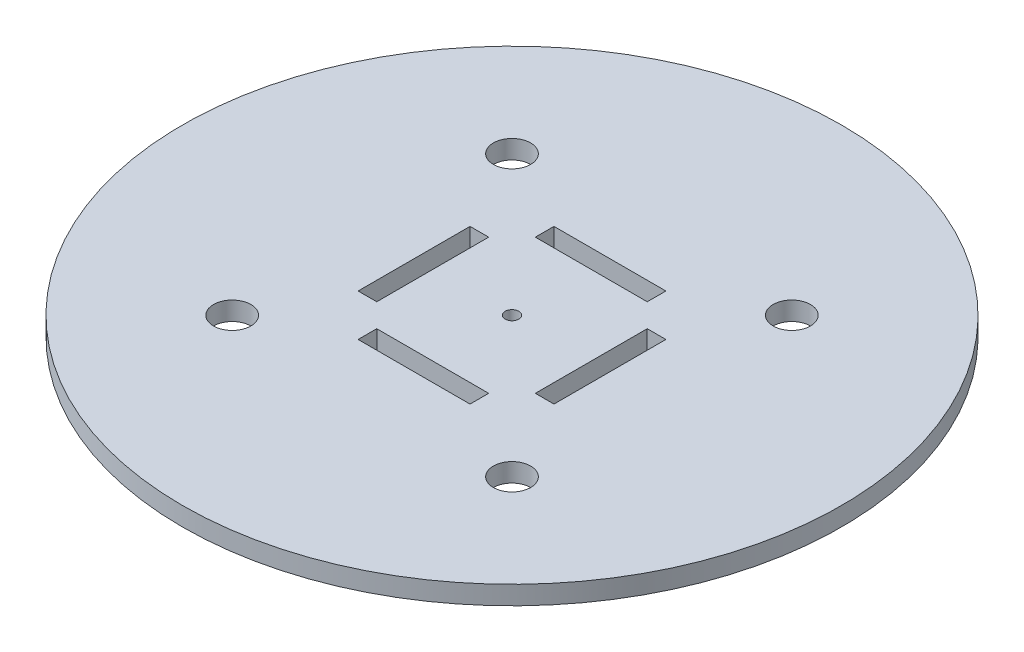
ISO-10303-21;
HEADER;
FILE_DESCRIPTION(('STEP AP214'),'2;1');
FILE_NAME('part.step','',(''),(''),'','','');
FILE_SCHEMA(('AUTOMOTIVE_DESIGN { 1 0 10303 214 1 1 1 1 }'));
ENDSEC;
DATA;
#1=APPLICATION_CONTEXT('core data for automotive mechanical design processes');
#2=APPLICATION_PROTOCOL_DEFINITION('international standard','automotive_design',2000,#1);
#3=PRODUCT_CONTEXT('',#1,'mechanical');
#4=PRODUCT('Part','Part','',(#3));
#5=PRODUCT_RELATED_PRODUCT_CATEGORY('part','',(#4));
#6=PRODUCT_DEFINITION_FORMATION('','',#4);
#7=PRODUCT_DEFINITION_CONTEXT('part definition',#1,'design');
#8=PRODUCT_DEFINITION('design','',#6,#7);
#9=PRODUCT_DEFINITION_SHAPE('','',#8);
#10=(LENGTH_UNIT() NAMED_UNIT(*) SI_UNIT(.MILLI.,.METRE.));
#11=(NAMED_UNIT(*) PLANE_ANGLE_UNIT() SI_UNIT($,.RADIAN.));
#12=(NAMED_UNIT(*) SI_UNIT($,.STERADIAN.) SOLID_ANGLE_UNIT());
#13=UNCERTAINTY_MEASURE_WITH_UNIT(LENGTH_MEASURE(1.E-05),#10,'distance_accuracy_value','');
#14=(GEOMETRIC_REPRESENTATION_CONTEXT(3) GLOBAL_UNCERTAINTY_ASSIGNED_CONTEXT((#13)) GLOBAL_UNIT_ASSIGNED_CONTEXT((#10,
#11,#12)) REPRESENTATION_CONTEXT('',''));
#15=CARTESIAN_POINT('',(0.,0.,0.));
#16=DIRECTION('',(0.,0.,1.));
#17=DIRECTION('',(1.,0.,0.));
#18=AXIS2_PLACEMENT_3D('',#15,#16,#17);
#19=CARTESIAN_POINT('',(0.,3.,0.));
#20=DIRECTION('',(0.,-1.,0.));
#21=DIRECTION('',(0.,0.,-1.));
#22=AXIS2_PLACEMENT_3D('',#19,#20,#21);
#23=CYLINDRICAL_SURFACE('',#22,53.);
#24=CARTESIAN_POINT('',(0.,3.,0.));
#25=DIRECTION('',(0.,1.,0.));
#26=DIRECTION('',(0.,0.,1.));
#27=AXIS2_PLACEMENT_3D('',#24,#25,#26);
#28=CIRCLE('',#27,53.);
#29=CARTESIAN_POINT('',(0.,3.,53.));
#30=VERTEX_POINT('',#29);
#31=EDGE_CURVE('E11',#30,#30,#28,.T.);
#32=ORIENTED_EDGE('',*,*,#31,.F.);
#33=EDGE_LOOP('',(#32));
#34=FACE_BOUND('',#33,.T.);
#35=CARTESIAN_POINT('',(0.,0.,0.));
#36=DIRECTION('',(0.,1.,0.));
#37=DIRECTION('',(0.,0.,1.));
#38=AXIS2_PLACEMENT_3D('',#35,#36,#37);
#39=CIRCLE('',#38,53.);
#40=CARTESIAN_POINT('',(0.,0.,53.));
#41=VERTEX_POINT('',#40);
#42=EDGE_CURVE('E36',#41,#41,#39,.T.);
#43=ORIENTED_EDGE('',*,*,#42,.T.);
#44=EDGE_LOOP('',(#43));
#45=FACE_BOUND('',#44,.T.);
#46=ADVANCED_FACE('F33',(#34,#45),#23,.T.);
#47=CARTESIAN_POINT('',(0.,3.,0.));
#48=DIRECTION('',(0.,1.,0.));
#49=DIRECTION('',(0.,0.,1.));
#50=AXIS2_PLACEMENT_3D('',#47,#48,#49);
#51=PLANE('',#50);
#52=CARTESIAN_POINT('',(22.5,3.,22.5));
#53=DIRECTION('',(0.,1.,0.));
#54=DIRECTION('',(0.,0.,-1.));
#55=AXIS2_PLACEMENT_3D('',#52,#53,#54);
#56=CIRCLE('',#55,3.);
#57=CARTESIAN_POINT('',(22.5,3.,19.5));
#58=VERTEX_POINT('',#57);
#59=EDGE_CURVE('E427',#58,#58,#56,.T.);
#60=ORIENTED_EDGE('',*,*,#59,.F.);
#61=EDGE_LOOP('',(#60));
#62=FACE_BOUND('',#61,.T.);
#63=CARTESIAN_POINT('',(22.4999999999998,3.,-22.5000000000002));
#64=DIRECTION('',(0.,1.,0.));
#65=DIRECTION('',(-1.,0.,0.));
#66=AXIS2_PLACEMENT_3D('',#63,#64,#65);
#67=CIRCLE('',#66,3.);
#68=CARTESIAN_POINT('',(19.4999999999998,3.,-22.5000000000002));
#69=VERTEX_POINT('',#68);
#70=EDGE_CURVE('E433',#69,#69,#67,.T.);
#71=ORIENTED_EDGE('',*,*,#70,.F.);
#72=EDGE_LOOP('',(#71));
#73=FACE_BOUND('',#72,.T.);
#74=CARTESIAN_POINT('',(-22.4999999999999,3.,22.5000000000001));
#75=DIRECTION('',(0.,1.,0.));
#76=DIRECTION('',(1.,0.,0.));
#77=AXIS2_PLACEMENT_3D('',#74,#75,#76);
#78=CIRCLE('',#77,3.);
#79=CARTESIAN_POINT('',(-19.4999999999999,3.,22.5000000000001));
#80=VERTEX_POINT('',#79);
#81=EDGE_CURVE('E430',#80,#80,#78,.T.);
#82=ORIENTED_EDGE('',*,*,#81,.F.);
#83=EDGE_LOOP('',(#82));
#84=FACE_BOUND('',#83,.T.);
#85=CARTESIAN_POINT('',(-22.5,3.,-22.5));
#86=DIRECTION('',(0.,1.,0.));
#87=DIRECTION('',(0.,0.,1.));
#88=AXIS2_PLACEMENT_3D('',#85,#86,#87);
#89=CIRCLE('',#88,3.);
#90=CARTESIAN_POINT('',(-22.5,3.,-19.5));
#91=VERTEX_POINT('',#90);
#92=EDGE_CURVE('E172',#91,#91,#89,.T.);
#93=ORIENTED_EDGE('',*,*,#92,.F.);
#94=EDGE_LOOP('',(#93));
#95=FACE_BOUND('',#94,.T.);
#96=CARTESIAN_POINT('',(0.,3.,0.));
#97=DIRECTION('',(0.,1.,0.));
#98=DIRECTION('',(0.,0.,1.));
#99=AXIS2_PLACEMENT_3D('',#96,#97,#98);
#100=CIRCLE('',#99,1.1);
#101=CARTESIAN_POINT('',(0.,3.,1.1));
#102=VERTEX_POINT('',#101);
#103=EDGE_CURVE('E190',#102,#102,#100,.T.);
#104=ORIENTED_EDGE('',*,*,#103,.F.);
#105=EDGE_LOOP('',(#104));
#106=FACE_BOUND('',#105,.T.);
#107=DIRECTION('',(0.,0.,1.));
#108=VECTOR('',#107,1.);
#109=CARTESIAN_POINT('',(12.75,3.,-9.));
#110=LINE('',#109,#108);
#111=CARTESIAN_POINT('',(12.75,3.,-9.));
#112=VERTEX_POINT('',#111);
#113=CARTESIAN_POINT('',(12.75,3.,9.));
#114=VERTEX_POINT('',#113);
#115=EDGE_CURVE('E47',#112,#114,#110,.T.);
#116=ORIENTED_EDGE('',*,*,#115,.F.);
#117=DIRECTION('',(-1.,0.,0.));
#118=VECTOR('',#117,1.);
#119=CARTESIAN_POINT('',(12.75,3.,-9.));
#120=LINE('',#119,#118);
#121=CARTESIAN_POINT('',(15.75,3.,-9.));
#122=VERTEX_POINT('',#121);
#123=EDGE_CURVE('E166',#122,#112,#120,.T.);
#124=ORIENTED_EDGE('',*,*,#123,.F.);
#125=DIRECTION('',(0.,0.,-1.));
#126=VECTOR('',#125,1.);
#127=CARTESIAN_POINT('',(15.75,3.,-9.));
#128=LINE('',#127,#126);
#129=CARTESIAN_POINT('',(15.75,3.,9.));
#130=VERTEX_POINT('',#129);
#131=EDGE_CURVE('E169',#130,#122,#128,.T.);
#132=ORIENTED_EDGE('',*,*,#131,.F.);
#133=DIRECTION('',(1.,0.,0.));
#134=VECTOR('',#133,1.);
#135=CARTESIAN_POINT('',(12.75,3.,9.));
#136=LINE('',#135,#134);
#137=EDGE_CURVE('E178',#114,#130,#136,.T.);
#138=ORIENTED_EDGE('',*,*,#137,.F.);
#139=EDGE_LOOP('',(#116,#124,#132,#138));
#140=FACE_BOUND('',#139,.T.);
#141=DIRECTION('',(0.,0.,1.));
#142=VECTOR('',#141,1.);
#143=CARTESIAN_POINT('',(-9.,3.,12.75));
#144=LINE('',#143,#142);
#145=CARTESIAN_POINT('',(-9.,3.,12.75));
#146=VERTEX_POINT('',#145);
#147=CARTESIAN_POINT('',(-8.99999999999999,3.,15.75));
#148=VERTEX_POINT('',#147);
#149=EDGE_CURVE('E55',#146,#148,#144,.T.);
#150=ORIENTED_EDGE('',*,*,#149,.F.);
#151=DIRECTION('',(-1.,0.,0.));
#152=VECTOR('',#151,1.);
#153=CARTESIAN_POINT('',(-9.,3.,12.75));
#154=LINE('',#153,#152);
#155=CARTESIAN_POINT('',(9.,3.,12.75));
#156=VERTEX_POINT('',#155);
#157=EDGE_CURVE('E232',#156,#146,#154,.T.);
#158=ORIENTED_EDGE('',*,*,#157,.F.);
#159=DIRECTION('',(0.,0.,-1.));
#160=VECTOR('',#159,1.);
#161=CARTESIAN_POINT('',(9.,3.,12.75));
#162=LINE('',#161,#160);
#163=CARTESIAN_POINT('',(9.00000000000001,3.,15.75));
#164=VERTEX_POINT('',#163);
#165=EDGE_CURVE('E246',#164,#156,#162,.T.);
#166=ORIENTED_EDGE('',*,*,#165,.F.);
#167=DIRECTION('',(1.,0.,0.));
#168=VECTOR('',#167,1.);
#169=CARTESIAN_POINT('',(-8.99999999999999,3.,15.75));
#170=LINE('',#169,#168);
#171=EDGE_CURVE('E243',#148,#164,#170,.T.);
#172=ORIENTED_EDGE('',*,*,#171,.F.);
#173=EDGE_LOOP('',(#150,#158,#166,#172));
#174=FACE_BOUND('',#173,.T.);
#175=DIRECTION('',(0.,0.,1.));
#176=VECTOR('',#175,1.);
#177=CARTESIAN_POINT('',(-15.75,3.,-9.));
#178=LINE('',#177,#176);
#179=CARTESIAN_POINT('',(-15.75,3.,-9.));
#180=VERTEX_POINT('',#179);
#181=CARTESIAN_POINT('',(-15.75,3.,9.));
#182=VERTEX_POINT('',#181);
#183=EDGE_CURVE('E208',#180,#182,#178,.T.);
#184=ORIENTED_EDGE('',*,*,#183,.F.);
#185=DIRECTION('',(-1.,0.,0.));
#186=VECTOR('',#185,1.);
#187=CARTESIAN_POINT('',(-15.75,3.,-9.));
#188=LINE('',#187,#186);
#189=CARTESIAN_POINT('',(-12.75,3.,-9.));
#190=VERTEX_POINT('',#189);
#191=EDGE_CURVE('E198',#190,#180,#188,.T.);
#192=ORIENTED_EDGE('',*,*,#191,.F.);
#193=DIRECTION('',(0.,0.,-1.));
#194=VECTOR('',#193,1.);
#195=CARTESIAN_POINT('',(-12.75,3.,-9.));
#196=LINE('',#195,#194);
#197=CARTESIAN_POINT('',(-12.75,3.,9.));
#198=VERTEX_POINT('',#197);
#199=EDGE_CURVE('E214',#198,#190,#196,.T.);
#200=ORIENTED_EDGE('',*,*,#199,.F.);
#201=DIRECTION('',(1.,0.,0.));
#202=VECTOR('',#201,1.);
#203=CARTESIAN_POINT('',(-15.75,3.,9.));
#204=LINE('',#203,#202);
#205=EDGE_CURVE('E210',#182,#198,#204,.T.);
#206=ORIENTED_EDGE('',*,*,#205,.F.);
#207=EDGE_LOOP('',(#184,#192,#200,#206));
#208=FACE_BOUND('',#207,.T.);
#209=DIRECTION('',(0.,0.,1.));
#210=VECTOR('',#209,1.);
#211=CARTESIAN_POINT('',(-9.,3.,-15.75));
#212=LINE('',#211,#210);
#213=CARTESIAN_POINT('',(-9.,3.,-15.75));
#214=VERTEX_POINT('',#213);
#215=CARTESIAN_POINT('',(-9.,3.,-12.75));
#216=VERTEX_POINT('',#215);
#217=EDGE_CURVE('E221',#214,#216,#212,.T.);
#218=ORIENTED_EDGE('',*,*,#217,.F.);
#219=DIRECTION('',(-1.,0.,0.));
#220=VECTOR('',#219,1.);
#221=CARTESIAN_POINT('',(-9.,3.,-15.75));
#222=LINE('',#221,#220);
#223=CARTESIAN_POINT('',(9.,3.,-15.75));
#224=VERTEX_POINT('',#223);
#225=EDGE_CURVE('E261',#224,#214,#222,.T.);
#226=ORIENTED_EDGE('',*,*,#225,.F.);
#227=DIRECTION('',(0.,0.,-1.));
#228=VECTOR('',#227,1.);
#229=CARTESIAN_POINT('',(9.,3.,-15.75));
#230=LINE('',#229,#228);
#231=CARTESIAN_POINT('',(9.,3.,-12.75));
#232=VERTEX_POINT('',#231);
#233=EDGE_CURVE('E275',#232,#224,#230,.T.);
#234=ORIENTED_EDGE('',*,*,#233,.F.);
#235=DIRECTION('',(1.,0.,0.));
#236=VECTOR('',#235,1.);
#237=CARTESIAN_POINT('',(-9.,3.,-12.75));
#238=LINE('',#237,#236);
#239=EDGE_CURVE('E272',#216,#232,#238,.T.);
#240=ORIENTED_EDGE('',*,*,#239,.F.);
#241=EDGE_LOOP('',(#218,#226,#234,#240));
#242=FACE_BOUND('',#241,.T.);
#243=ORIENTED_EDGE('',*,*,#31,.T.);
#244=EDGE_LOOP('',(#243));
#245=FACE_BOUND('',#244,.T.);
#246=ADVANCED_FACE('F297',(#62,#73,#84,#95,#106,#140,#174,#208,#242,#245),#51,.T.);
#247=CARTESIAN_POINT('',(0.,0.,0.));
#248=DIRECTION('',(0.,1.,0.));
#249=DIRECTION('',(0.,0.,1.));
#250=AXIS2_PLACEMENT_3D('',#247,#248,#249);
#251=PLANE('',#250);
#252=CARTESIAN_POINT('',(22.5,0.,22.5));
#253=DIRECTION('',(0.,1.,0.));
#254=DIRECTION('',(0.,0.,-1.));
#255=AXIS2_PLACEMENT_3D('',#252,#253,#254);
#256=CIRCLE('',#255,3.);
#257=CARTESIAN_POINT('',(22.5,0.,19.5));
#258=VERTEX_POINT('',#257);
#259=EDGE_CURVE('E424',#258,#258,#256,.T.);
#260=ORIENTED_EDGE('',*,*,#259,.T.);
#261=EDGE_LOOP('',(#260));
#262=FACE_BOUND('',#261,.T.);
#263=CARTESIAN_POINT('',(22.4999999999998,0.,-22.5000000000002));
#264=DIRECTION('',(0.,1.,0.));
#265=DIRECTION('',(-1.,0.,0.));
#266=AXIS2_PLACEMENT_3D('',#263,#264,#265);
#267=CIRCLE('',#266,3.);
#268=CARTESIAN_POINT('',(19.4999999999998,0.,-22.5000000000002));
#269=VERTEX_POINT('',#268);
#270=EDGE_CURVE('E428',#269,#269,#267,.T.);
#271=ORIENTED_EDGE('',*,*,#270,.T.);
#272=EDGE_LOOP('',(#271));
#273=FACE_BOUND('',#272,.T.);
#274=CARTESIAN_POINT('',(-22.4999999999999,0.,22.5000000000001));
#275=DIRECTION('',(0.,1.,0.));
#276=DIRECTION('',(1.,0.,0.));
#277=AXIS2_PLACEMENT_3D('',#274,#275,#276);
#278=CIRCLE('',#277,3.);
#279=CARTESIAN_POINT('',(-19.4999999999999,0.,22.5000000000001));
#280=VERTEX_POINT('',#279);
#281=EDGE_CURVE('E438',#280,#280,#278,.T.);
#282=ORIENTED_EDGE('',*,*,#281,.T.);
#283=EDGE_LOOP('',(#282));
#284=FACE_BOUND('',#283,.T.);
#285=CARTESIAN_POINT('',(-22.5,0.,-22.5));
#286=DIRECTION('',(0.,1.,0.));
#287=DIRECTION('',(0.,0.,1.));
#288=AXIS2_PLACEMENT_3D('',#285,#286,#287);
#289=CIRCLE('',#288,3.);
#290=CARTESIAN_POINT('',(-22.5,0.,-19.5));
#291=VERTEX_POINT('',#290);
#292=EDGE_CURVE('E193',#291,#291,#289,.T.);
#293=ORIENTED_EDGE('',*,*,#292,.T.);
#294=EDGE_LOOP('',(#293));
#295=FACE_BOUND('',#294,.T.);
#296=CARTESIAN_POINT('',(0.,0.,0.));
#297=DIRECTION('',(0.,1.,0.));
#298=DIRECTION('',(0.,0.,1.));
#299=AXIS2_PLACEMENT_3D('',#296,#297,#298);
#300=CIRCLE('',#299,1.1);
#301=CARTESIAN_POINT('',(0.,0.,1.1));
#302=VERTEX_POINT('',#301);
#303=EDGE_CURVE('E179',#302,#302,#300,.T.);
#304=ORIENTED_EDGE('',*,*,#303,.T.);
#305=EDGE_LOOP('',(#304));
#306=FACE_BOUND('',#305,.T.);
#307=DIRECTION('',(-1.,0.,0.));
#308=VECTOR('',#307,1.);
#309=CARTESIAN_POINT('',(12.75,0.,-9.));
#310=LINE('',#309,#308);
#311=CARTESIAN_POINT('',(15.75,0.,-9.));
#312=VERTEX_POINT('',#311);
#313=CARTESIAN_POINT('',(12.75,0.,-9.));
#314=VERTEX_POINT('',#313);
#315=EDGE_CURVE('E153',#312,#314,#310,.T.);
#316=ORIENTED_EDGE('',*,*,#315,.T.);
#317=DIRECTION('',(0.,0.,1.));
#318=VECTOR('',#317,1.);
#319=CARTESIAN_POINT('',(12.75,0.,-9.));
#320=LINE('',#319,#318);
#321=CARTESIAN_POINT('',(12.75,0.,9.));
#322=VERTEX_POINT('',#321);
#323=EDGE_CURVE('E147',#314,#322,#320,.T.);
#324=ORIENTED_EDGE('',*,*,#323,.T.);
#325=DIRECTION('',(1.,0.,0.));
#326=VECTOR('',#325,1.);
#327=CARTESIAN_POINT('',(12.75,0.,9.));
#328=LINE('',#327,#326);
#329=CARTESIAN_POINT('',(15.75,0.,9.));
#330=VERTEX_POINT('',#329);
#331=EDGE_CURVE('E157',#322,#330,#328,.T.);
#332=ORIENTED_EDGE('',*,*,#331,.T.);
#333=DIRECTION('',(0.,0.,-1.));
#334=VECTOR('',#333,1.);
#335=CARTESIAN_POINT('',(15.75,0.,-9.));
#336=LINE('',#335,#334);
#337=EDGE_CURVE('E161',#330,#312,#336,.T.);
#338=ORIENTED_EDGE('',*,*,#337,.T.);
#339=EDGE_LOOP('',(#316,#324,#332,#338));
#340=FACE_BOUND('',#339,.T.);
#341=DIRECTION('',(-1.,0.,0.));
#342=VECTOR('',#341,1.);
#343=CARTESIAN_POINT('',(-9.,0.,12.75));
#344=LINE('',#343,#342);
#345=CARTESIAN_POINT('',(9.,0.,12.75));
#346=VERTEX_POINT('',#345);
#347=CARTESIAN_POINT('',(-9.,0.,12.75));
#348=VERTEX_POINT('',#347);
#349=EDGE_CURVE('E238',#346,#348,#344,.T.);
#350=ORIENTED_EDGE('',*,*,#349,.T.);
#351=DIRECTION('',(0.,0.,1.));
#352=VECTOR('',#351,1.);
#353=CARTESIAN_POINT('',(-9.,0.,12.75));
#354=LINE('',#353,#352);
#355=CARTESIAN_POINT('',(-8.99999999999999,0.,15.75));
#356=VERTEX_POINT('',#355);
#357=EDGE_CURVE('E228',#348,#356,#354,.T.);
#358=ORIENTED_EDGE('',*,*,#357,.T.);
#359=DIRECTION('',(1.,0.,0.));
#360=VECTOR('',#359,1.);
#361=CARTESIAN_POINT('',(-8.99999999999999,0.,15.75));
#362=LINE('',#361,#360);
#363=CARTESIAN_POINT('',(9.00000000000001,0.,15.75));
#364=VERTEX_POINT('',#363);
#365=EDGE_CURVE('E231',#356,#364,#362,.T.);
#366=ORIENTED_EDGE('',*,*,#365,.T.);
#367=DIRECTION('',(0.,0.,-1.));
#368=VECTOR('',#367,1.);
#369=CARTESIAN_POINT('',(9.,0.,12.75));
#370=LINE('',#369,#368);
#371=EDGE_CURVE('E235',#364,#346,#370,.T.);
#372=ORIENTED_EDGE('',*,*,#371,.T.);
#373=EDGE_LOOP('',(#350,#358,#366,#372));
#374=FACE_BOUND('',#373,.T.);
#375=DIRECTION('',(-1.,0.,0.));
#376=VECTOR('',#375,1.);
#377=CARTESIAN_POINT('',(-15.75,0.,-9.));
#378=LINE('',#377,#376);
#379=CARTESIAN_POINT('',(-12.75,0.,-9.));
#380=VERTEX_POINT('',#379);
#381=CARTESIAN_POINT('',(-15.75,0.,-9.));
#382=VERTEX_POINT('',#381);
#383=EDGE_CURVE('E204',#380,#382,#378,.T.);
#384=ORIENTED_EDGE('',*,*,#383,.T.);
#385=DIRECTION('',(0.,0.,1.));
#386=VECTOR('',#385,1.);
#387=CARTESIAN_POINT('',(-15.75,0.,-9.));
#388=LINE('',#387,#386);
#389=CARTESIAN_POINT('',(-15.75,0.,9.));
#390=VERTEX_POINT('',#389);
#391=EDGE_CURVE('E194',#382,#390,#388,.T.);
#392=ORIENTED_EDGE('',*,*,#391,.T.);
#393=DIRECTION('',(1.,0.,0.));
#394=VECTOR('',#393,1.);
#395=CARTESIAN_POINT('',(-15.75,0.,9.));
#396=LINE('',#395,#394);
#397=CARTESIAN_POINT('',(-12.75,0.,9.));
#398=VERTEX_POINT('',#397);
#399=EDGE_CURVE('E197',#390,#398,#396,.T.);
#400=ORIENTED_EDGE('',*,*,#399,.T.);
#401=DIRECTION('',(0.,0.,-1.));
#402=VECTOR('',#401,1.);
#403=CARTESIAN_POINT('',(-12.75,0.,-9.));
#404=LINE('',#403,#402);
#405=EDGE_CURVE('E201',#398,#380,#404,.T.);
#406=ORIENTED_EDGE('',*,*,#405,.T.);
#407=EDGE_LOOP('',(#384,#392,#400,#406));
#408=FACE_BOUND('',#407,.T.);
#409=DIRECTION('',(-1.,0.,0.));
#410=VECTOR('',#409,1.);
#411=CARTESIAN_POINT('',(-9.,0.,-15.75));
#412=LINE('',#411,#410);
#413=CARTESIAN_POINT('',(9.,0.,-15.75));
#414=VERTEX_POINT('',#413);
#415=CARTESIAN_POINT('',(-9.,0.,-15.75));
#416=VERTEX_POINT('',#415);
#417=EDGE_CURVE('E267',#414,#416,#412,.T.);
#418=ORIENTED_EDGE('',*,*,#417,.T.);
#419=DIRECTION('',(0.,0.,1.));
#420=VECTOR('',#419,1.);
#421=CARTESIAN_POINT('',(-9.,0.,-15.75));
#422=LINE('',#421,#420);
#423=CARTESIAN_POINT('',(-9.,0.,-12.75));
#424=VERTEX_POINT('',#423);
#425=EDGE_CURVE('E257',#416,#424,#422,.T.);
#426=ORIENTED_EDGE('',*,*,#425,.T.);
#427=DIRECTION('',(1.,0.,0.));
#428=VECTOR('',#427,1.);
#429=CARTESIAN_POINT('',(-9.,0.,-12.75));
#430=LINE('',#429,#428);
#431=CARTESIAN_POINT('',(9.,0.,-12.75));
#432=VERTEX_POINT('',#431);
#433=EDGE_CURVE('E260',#424,#432,#430,.T.);
#434=ORIENTED_EDGE('',*,*,#433,.T.);
#435=DIRECTION('',(0.,0.,-1.));
#436=VECTOR('',#435,1.);
#437=CARTESIAN_POINT('',(9.,0.,-15.75));
#438=LINE('',#437,#436);
#439=EDGE_CURVE('E264',#432,#414,#438,.T.);
#440=ORIENTED_EDGE('',*,*,#439,.T.);
#441=EDGE_LOOP('',(#418,#426,#434,#440));
#442=FACE_BOUND('',#441,.T.);
#443=ORIENTED_EDGE('',*,*,#42,.F.);
#444=EDGE_LOOP('',(#443));
#445=FACE_BOUND('',#444,.T.);
#446=ADVANCED_FACE('F163',(#262,#273,#284,#295,#306,#340,#374,#408,#442,#445),#251,.F.);
#447=CARTESIAN_POINT('',(-9.,0.,-15.75));
#448=DIRECTION('',(-1.,0.,0.));
#449=DIRECTION('',(0.,0.,1.));
#450=AXIS2_PLACEMENT_3D('',#447,#448,#449);
#451=PLANE('',#450);
#452=ORIENTED_EDGE('',*,*,#217,.T.);
#453=DIRECTION('',(0.,1.,0.));
#454=VECTOR('',#453,1.);
#455=CARTESIAN_POINT('',(-9.,0.,-12.75));
#456=LINE('',#455,#454);
#457=EDGE_CURVE('E270',#424,#216,#456,.T.);
#458=ORIENTED_EDGE('',*,*,#457,.F.);
#459=ORIENTED_EDGE('',*,*,#425,.F.);
#460=DIRECTION('',(0.,1.,0.));
#461=VECTOR('',#460,1.);
#462=CARTESIAN_POINT('',(-9.,0.,-15.75));
#463=LINE('',#462,#461);
#464=EDGE_CURVE('E280',#416,#214,#463,.T.);
#465=ORIENTED_EDGE('',*,*,#464,.T.);
#466=EDGE_LOOP('',(#452,#458,#459,#465));
#467=FACE_BOUND('',#466,.T.);
#468=ADVANCED_FACE('F305',(#467),#451,.F.);
#469=CARTESIAN_POINT('',(-9.,0.,-15.75));
#470=DIRECTION('',(0.,0.,-1.));
#471=DIRECTION('',(-1.,0.,0.));
#472=AXIS2_PLACEMENT_3D('',#469,#470,#471);
#473=PLANE('',#472);
#474=ORIENTED_EDGE('',*,*,#225,.T.);
#475=ORIENTED_EDGE('',*,*,#464,.F.);
#476=ORIENTED_EDGE('',*,*,#417,.F.);
#477=DIRECTION('',(0.,1.,0.));
#478=VECTOR('',#477,1.);
#479=CARTESIAN_POINT('',(9.,0.,-15.75));
#480=LINE('',#479,#478);
#481=EDGE_CURVE('E282',#414,#224,#480,.T.);
#482=ORIENTED_EDGE('',*,*,#481,.T.);
#483=EDGE_LOOP('',(#474,#475,#476,#482));
#484=FACE_BOUND('',#483,.T.);
#485=ADVANCED_FACE('F307',(#484),#473,.F.);
#486=CARTESIAN_POINT('',(9.,0.,-15.75));
#487=DIRECTION('',(1.,0.,0.));
#488=DIRECTION('',(0.,0.,-1.));
#489=AXIS2_PLACEMENT_3D('',#486,#487,#488);
#490=PLANE('',#489);
#491=ORIENTED_EDGE('',*,*,#233,.T.);
#492=ORIENTED_EDGE('',*,*,#481,.F.);
#493=ORIENTED_EDGE('',*,*,#439,.F.);
#494=DIRECTION('',(0.,1.,0.));
#495=VECTOR('',#494,1.);
#496=CARTESIAN_POINT('',(9.,0.,-12.75));
#497=LINE('',#496,#495);
#498=EDGE_CURVE('E284',#432,#232,#497,.T.);
#499=ORIENTED_EDGE('',*,*,#498,.T.);
#500=EDGE_LOOP('',(#491,#492,#493,#499));
#501=FACE_BOUND('',#500,.T.);
#502=ADVANCED_FACE('F301',(#501),#490,.F.);
#503=CARTESIAN_POINT('',(-9.,0.,-12.75));
#504=DIRECTION('',(0.,0.,1.));
#505=DIRECTION('',(1.,0.,0.));
#506=AXIS2_PLACEMENT_3D('',#503,#504,#505);
#507=PLANE('',#506);
#508=ORIENTED_EDGE('',*,*,#239,.T.);
#509=ORIENTED_EDGE('',*,*,#498,.F.);
#510=ORIENTED_EDGE('',*,*,#433,.F.);
#511=ORIENTED_EDGE('',*,*,#457,.T.);
#512=EDGE_LOOP('',(#508,#509,#510,#511));
#513=FACE_BOUND('',#512,.T.);
#514=ADVANCED_FACE('F290',(#513),#507,.F.);
#515=CARTESIAN_POINT('',(-15.75,0.,-9.));
#516=DIRECTION('',(-1.,0.,0.));
#517=DIRECTION('',(0.,0.,1.));
#518=AXIS2_PLACEMENT_3D('',#515,#516,#517);
#519=PLANE('',#518);
#520=ORIENTED_EDGE('',*,*,#183,.T.);
#521=DIRECTION('',(0.,1.,0.));
#522=VECTOR('',#521,1.);
#523=CARTESIAN_POINT('',(-15.75,0.,9.));
#524=LINE('',#523,#522);
#525=EDGE_CURVE('E207',#390,#182,#524,.T.);
#526=ORIENTED_EDGE('',*,*,#525,.F.);
#527=ORIENTED_EDGE('',*,*,#391,.F.);
#528=DIRECTION('',(0.,1.,0.));
#529=VECTOR('',#528,1.);
#530=CARTESIAN_POINT('',(-15.75,0.,-9.));
#531=LINE('',#530,#529);
#532=EDGE_CURVE('E219',#382,#180,#531,.T.);
#533=ORIENTED_EDGE('',*,*,#532,.T.);
#534=EDGE_LOOP('',(#520,#526,#527,#533));
#535=FACE_BOUND('',#534,.T.);
#536=ADVANCED_FACE('F338',(#535),#519,.F.);
#537=CARTESIAN_POINT('',(-15.75,0.,-9.));
#538=DIRECTION('',(0.,0.,-1.));
#539=DIRECTION('',(-1.,0.,0.));
#540=AXIS2_PLACEMENT_3D('',#537,#538,#539);
#541=PLANE('',#540);
#542=ORIENTED_EDGE('',*,*,#191,.T.);
#543=ORIENTED_EDGE('',*,*,#532,.F.);
#544=ORIENTED_EDGE('',*,*,#383,.F.);
#545=DIRECTION('',(0.,1.,0.));
#546=VECTOR('',#545,1.);
#547=CARTESIAN_POINT('',(-12.75,0.,-9.));
#548=LINE('',#547,#546);
#549=EDGE_CURVE('E222',#380,#190,#548,.T.);
#550=ORIENTED_EDGE('',*,*,#549,.T.);
#551=EDGE_LOOP('',(#542,#543,#544,#550));
#552=FACE_BOUND('',#551,.T.);
#553=ADVANCED_FACE('F342',(#552),#541,.F.);
#554=CARTESIAN_POINT('',(-12.75,0.,-9.));
#555=DIRECTION('',(1.,0.,0.));
#556=DIRECTION('',(0.,0.,-1.));
#557=AXIS2_PLACEMENT_3D('',#554,#555,#556);
#558=PLANE('',#557);
#559=ORIENTED_EDGE('',*,*,#199,.T.);
#560=ORIENTED_EDGE('',*,*,#549,.F.);
#561=ORIENTED_EDGE('',*,*,#405,.F.);
#562=DIRECTION('',(0.,1.,0.));
#563=VECTOR('',#562,1.);
#564=CARTESIAN_POINT('',(-12.75,0.,9.));
#565=LINE('',#564,#563);
#566=EDGE_CURVE('E224',#398,#198,#565,.T.);
#567=ORIENTED_EDGE('',*,*,#566,.T.);
#568=EDGE_LOOP('',(#559,#560,#561,#567));
#569=FACE_BOUND('',#568,.T.);
#570=ADVANCED_FACE('F348',(#569),#558,.F.);
#571=CARTESIAN_POINT('',(-15.75,0.,9.));
#572=DIRECTION('',(0.,0.,1.));
#573=DIRECTION('',(1.,0.,0.));
#574=AXIS2_PLACEMENT_3D('',#571,#572,#573);
#575=PLANE('',#574);
#576=ORIENTED_EDGE('',*,*,#205,.T.);
#577=ORIENTED_EDGE('',*,*,#566,.F.);
#578=ORIENTED_EDGE('',*,*,#399,.F.);
#579=ORIENTED_EDGE('',*,*,#525,.T.);
#580=EDGE_LOOP('',(#576,#577,#578,#579));
#581=FACE_BOUND('',#580,.T.);
#582=ADVANCED_FACE('F353',(#581),#575,.F.);
#583=CARTESIAN_POINT('',(-9.,0.,12.75));
#584=DIRECTION('',(-1.,0.,0.));
#585=DIRECTION('',(0.,0.,1.));
#586=AXIS2_PLACEMENT_3D('',#583,#584,#585);
#587=PLANE('',#586);
#588=ORIENTED_EDGE('',*,*,#149,.T.);
#589=DIRECTION('',(0.,1.,0.));
#590=VECTOR('',#589,1.);
#591=CARTESIAN_POINT('',(-8.99999999999999,0.,15.75));
#592=LINE('',#591,#590);
#593=EDGE_CURVE('E241',#356,#148,#592,.T.);
#594=ORIENTED_EDGE('',*,*,#593,.F.);
#595=ORIENTED_EDGE('',*,*,#357,.F.);
#596=DIRECTION('',(0.,1.,0.));
#597=VECTOR('',#596,1.);
#598=CARTESIAN_POINT('',(-9.,0.,12.75));
#599=LINE('',#598,#597);
#600=EDGE_CURVE('E211',#348,#146,#599,.T.);
#601=ORIENTED_EDGE('',*,*,#600,.T.);
#602=EDGE_LOOP('',(#588,#594,#595,#601));
#603=FACE_BOUND('',#602,.T.);
#604=ADVANCED_FACE('F359',(#603),#587,.F.);
#605=CARTESIAN_POINT('',(-9.,0.,12.75));
#606=DIRECTION('',(0.,0.,-1.));
#607=DIRECTION('',(-1.,0.,0.));
#608=AXIS2_PLACEMENT_3D('',#605,#606,#607);
#609=PLANE('',#608);
#610=ORIENTED_EDGE('',*,*,#157,.T.);
#611=ORIENTED_EDGE('',*,*,#600,.F.);
#612=ORIENTED_EDGE('',*,*,#349,.F.);
#613=DIRECTION('',(0.,1.,0.));
#614=VECTOR('',#613,1.);
#615=CARTESIAN_POINT('',(9.,0.,12.75));
#616=LINE('',#615,#614);
#617=EDGE_CURVE('E252',#346,#156,#616,.T.);
#618=ORIENTED_EDGE('',*,*,#617,.T.);
#619=EDGE_LOOP('',(#610,#611,#612,#618));
#620=FACE_BOUND('',#619,.T.);
#621=ADVANCED_FACE('F355',(#620),#609,.F.);
#622=CARTESIAN_POINT('',(9.,0.,12.75));
#623=DIRECTION('',(1.,0.,0.));
#624=DIRECTION('',(0.,0.,-1.));
#625=AXIS2_PLACEMENT_3D('',#622,#623,#624);
#626=PLANE('',#625);
#627=ORIENTED_EDGE('',*,*,#165,.T.);
#628=ORIENTED_EDGE('',*,*,#617,.F.);
#629=ORIENTED_EDGE('',*,*,#371,.F.);
#630=DIRECTION('',(0.,1.,0.));
#631=VECTOR('',#630,1.);
#632=CARTESIAN_POINT('',(9.00000000000001,0.,15.75));
#633=LINE('',#632,#631);
#634=EDGE_CURVE('E254',#364,#164,#633,.T.);
#635=ORIENTED_EDGE('',*,*,#634,.T.);
#636=EDGE_LOOP('',(#627,#628,#629,#635));
#637=FACE_BOUND('',#636,.T.);
#638=ADVANCED_FACE('F358',(#637),#626,.F.);
#639=CARTESIAN_POINT('',(-8.99999999999999,0.,15.75));
#640=DIRECTION('',(0.,0.,1.));
#641=DIRECTION('',(1.,0.,0.));
#642=AXIS2_PLACEMENT_3D('',#639,#640,#641);
#643=PLANE('',#642);
#644=ORIENTED_EDGE('',*,*,#171,.T.);
#645=ORIENTED_EDGE('',*,*,#634,.F.);
#646=ORIENTED_EDGE('',*,*,#365,.F.);
#647=ORIENTED_EDGE('',*,*,#593,.T.);
#648=EDGE_LOOP('',(#644,#645,#646,#647));
#649=FACE_BOUND('',#648,.T.);
#650=ADVANCED_FACE('F363',(#649),#643,.F.);
#651=CARTESIAN_POINT('',(12.75,0.,-9.));
#652=DIRECTION('',(-1.,0.,0.));
#653=DIRECTION('',(0.,0.,1.));
#654=AXIS2_PLACEMENT_3D('',#651,#652,#653);
#655=PLANE('',#654);
#656=ORIENTED_EDGE('',*,*,#115,.T.);
#657=DIRECTION('',(0.,1.,0.));
#658=VECTOR('',#657,1.);
#659=CARTESIAN_POINT('',(12.75,0.,9.));
#660=LINE('',#659,#658);
#661=EDGE_CURVE('E143',#322,#114,#660,.T.);
#662=ORIENTED_EDGE('',*,*,#661,.F.);
#663=ORIENTED_EDGE('',*,*,#323,.F.);
#664=DIRECTION('',(0.,1.,0.));
#665=VECTOR('',#664,1.);
#666=CARTESIAN_POINT('',(12.75,0.,-9.));
#667=LINE('',#666,#665);
#668=EDGE_CURVE('E183',#314,#112,#667,.T.);
#669=ORIENTED_EDGE('',*,*,#668,.T.);
#670=EDGE_LOOP('',(#656,#662,#663,#669));
#671=FACE_BOUND('',#670,.T.);
#672=ADVANCED_FACE('F145',(#671),#655,.F.);
#673=CARTESIAN_POINT('',(12.75,0.,-9.));
#674=DIRECTION('',(0.,0.,-1.));
#675=DIRECTION('',(-1.,0.,0.));
#676=AXIS2_PLACEMENT_3D('',#673,#674,#675);
#677=PLANE('',#676);
#678=ORIENTED_EDGE('',*,*,#123,.T.);
#679=ORIENTED_EDGE('',*,*,#668,.F.);
#680=ORIENTED_EDGE('',*,*,#315,.F.);
#681=DIRECTION('',(0.,1.,0.));
#682=VECTOR('',#681,1.);
#683=CARTESIAN_POINT('',(15.75,0.,-9.));
#684=LINE('',#683,#682);
#685=EDGE_CURVE('E185',#312,#122,#684,.T.);
#686=ORIENTED_EDGE('',*,*,#685,.T.);
#687=EDGE_LOOP('',(#678,#679,#680,#686));
#688=FACE_BOUND('',#687,.T.);
#689=ADVANCED_FACE('F396',(#688),#677,.F.);
#690=CARTESIAN_POINT('',(15.75,0.,-9.));
#691=DIRECTION('',(1.,0.,0.));
#692=DIRECTION('',(0.,0.,-1.));
#693=AXIS2_PLACEMENT_3D('',#690,#691,#692);
#694=PLANE('',#693);
#695=ORIENTED_EDGE('',*,*,#131,.T.);
#696=ORIENTED_EDGE('',*,*,#685,.F.);
#697=ORIENTED_EDGE('',*,*,#337,.F.);
#698=DIRECTION('',(0.,1.,0.));
#699=VECTOR('',#698,1.);
#700=CARTESIAN_POINT('',(15.75,0.,9.));
#701=LINE('',#700,#699);
#702=EDGE_CURVE('E152',#330,#130,#701,.T.);
#703=ORIENTED_EDGE('',*,*,#702,.T.);
#704=EDGE_LOOP('',(#695,#696,#697,#703));
#705=FACE_BOUND('',#704,.T.);
#706=ADVANCED_FACE('F399',(#705),#694,.F.);
#707=CARTESIAN_POINT('',(12.75,0.,9.));
#708=DIRECTION('',(0.,0.,1.));
#709=DIRECTION('',(1.,0.,0.));
#710=AXIS2_PLACEMENT_3D('',#707,#708,#709);
#711=PLANE('',#710);
#712=ORIENTED_EDGE('',*,*,#137,.T.);
#713=ORIENTED_EDGE('',*,*,#702,.F.);
#714=ORIENTED_EDGE('',*,*,#331,.F.);
#715=ORIENTED_EDGE('',*,*,#661,.T.);
#716=EDGE_LOOP('',(#712,#713,#714,#715));
#717=FACE_BOUND('',#716,.T.);
#718=ADVANCED_FACE('F158',(#717),#711,.F.);
#719=CARTESIAN_POINT('',(0.,0.,0.));
#720=DIRECTION('',(0.,1.,0.));
#721=DIRECTION('',(0.,0.,1.));
#722=AXIS2_PLACEMENT_3D('',#719,#720,#721);
#723=CYLINDRICAL_SURFACE('',#722,1.1);
#724=ORIENTED_EDGE('',*,*,#303,.F.);
#725=EDGE_LOOP('',(#724));
#726=FACE_BOUND('',#725,.T.);
#727=ORIENTED_EDGE('',*,*,#103,.T.);
#728=EDGE_LOOP('',(#727));
#729=FACE_BOUND('',#728,.T.);
#730=ADVANCED_FACE('F389',(#726,#729),#723,.F.);
#731=CARTESIAN_POINT('',(-22.5,0.,-22.5));
#732=DIRECTION('',(0.,1.,0.));
#733=DIRECTION('',(0.,0.,1.));
#734=AXIS2_PLACEMENT_3D('',#731,#732,#733);
#735=CYLINDRICAL_SURFACE('',#734,3.);
#736=ORIENTED_EDGE('',*,*,#292,.F.);
#737=EDGE_LOOP('',(#736));
#738=FACE_BOUND('',#737,.T.);
#739=ORIENTED_EDGE('',*,*,#92,.T.);
#740=EDGE_LOOP('',(#739));
#741=FACE_BOUND('',#740,.T.);
#742=ADVANCED_FACE('F392',(#738,#741),#735,.F.);
#743=CARTESIAN_POINT('',(-22.4999999999999,0.,22.5000000000001));
#744=DIRECTION('',(0.,1.,0.));
#745=DIRECTION('',(0.,0.,1.));
#746=AXIS2_PLACEMENT_3D('',#743,#744,#745);
#747=CYLINDRICAL_SURFACE('',#746,3.);
#748=ORIENTED_EDGE('',*,*,#281,.F.);
#749=EDGE_LOOP('',(#748));
#750=FACE_BOUND('',#749,.T.);
#751=ORIENTED_EDGE('',*,*,#81,.T.);
#752=EDGE_LOOP('',(#751));
#753=FACE_BOUND('',#752,.T.);
#754=ADVANCED_FACE('F408',(#750,#753),#747,.F.);
#755=CARTESIAN_POINT('',(22.4999999999998,0.,-22.5000000000002));
#756=DIRECTION('',(0.,1.,0.));
#757=DIRECTION('',(0.,0.,1.));
#758=AXIS2_PLACEMENT_3D('',#755,#756,#757);
#759=CYLINDRICAL_SURFACE('',#758,3.);
#760=ORIENTED_EDGE('',*,*,#270,.F.);
#761=EDGE_LOOP('',(#760));
#762=FACE_BOUND('',#761,.T.);
#763=ORIENTED_EDGE('',*,*,#70,.T.);
#764=EDGE_LOOP('',(#763));
#765=FACE_BOUND('',#764,.T.);
#766=ADVANCED_FACE('F412',(#762,#765),#759,.F.);
#767=CARTESIAN_POINT('',(22.5,0.,22.5));
#768=DIRECTION('',(0.,1.,0.));
#769=DIRECTION('',(0.,0.,1.));
#770=AXIS2_PLACEMENT_3D('',#767,#768,#769);
#771=CYLINDRICAL_SURFACE('',#770,3.);
#772=ORIENTED_EDGE('',*,*,#259,.F.);
#773=EDGE_LOOP('',(#772));
#774=FACE_BOUND('',#773,.T.);
#775=ORIENTED_EDGE('',*,*,#59,.T.);
#776=EDGE_LOOP('',(#775));
#777=FACE_BOUND('',#776,.T.);
#778=ADVANCED_FACE('F416',(#774,#777),#771,.F.);
#779=CLOSED_SHELL('',(#46,#246,#446,#468,#485,#502,#514,#536,#553,#570,#582,#604,#621,#638,#650,
#672,#689,#706,#718,#730,#742,#754,#766,#778));
#780=MANIFOLD_SOLID_BREP('B2',#779);
#781=ADVANCED_BREP_SHAPE_REPRESENTATION('',(#18,#780),#14);
#782=SHAPE_DEFINITION_REPRESENTATION(#9,#781);
ENDSEC;
END-ISO-10303-21;
